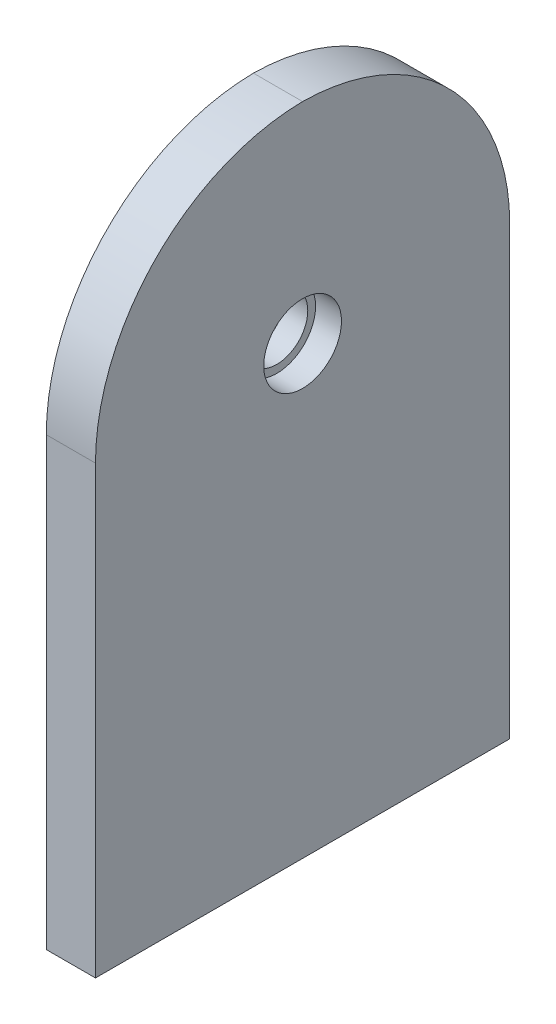
ISO-10303-21;
HEADER;
FILE_DESCRIPTION(('STEP AP214'),'2;1');
FILE_NAME('part.step','',(''),(''),'','','');
FILE_SCHEMA(('AUTOMOTIVE_DESIGN { 1 0 10303 214 1 1 1 1 }'));
ENDSEC;
DATA;
#1=APPLICATION_CONTEXT('core data for automotive mechanical design processes');
#2=APPLICATION_PROTOCOL_DEFINITION('international standard','automotive_design',2000,#1);
#3=PRODUCT_CONTEXT('',#1,'mechanical');
#4=PRODUCT('Part','Part','',(#3));
#5=PRODUCT_RELATED_PRODUCT_CATEGORY('part','',(#4));
#6=PRODUCT_DEFINITION_FORMATION('','',#4);
#7=PRODUCT_DEFINITION_CONTEXT('part definition',#1,'design');
#8=PRODUCT_DEFINITION('design','',#6,#7);
#9=PRODUCT_DEFINITION_SHAPE('','',#8);
#10=(LENGTH_UNIT() NAMED_UNIT(*) SI_UNIT(.MILLI.,.METRE.));
#11=(NAMED_UNIT(*) PLANE_ANGLE_UNIT() SI_UNIT($,.RADIAN.));
#12=(NAMED_UNIT(*) SI_UNIT($,.STERADIAN.) SOLID_ANGLE_UNIT());
#13=UNCERTAINTY_MEASURE_WITH_UNIT(LENGTH_MEASURE(1.E-05),#10,'distance_accuracy_value','');
#14=(GEOMETRIC_REPRESENTATION_CONTEXT(3) GLOBAL_UNCERTAINTY_ASSIGNED_CONTEXT((#13)) GLOBAL_UNIT_ASSIGNED_CONTEXT((#10,
#11,#12)) REPRESENTATION_CONTEXT('',''));
#15=CARTESIAN_POINT('',(0.,0.,0.));
#16=DIRECTION('',(0.,0.,1.));
#17=DIRECTION('',(1.,0.,0.));
#18=AXIS2_PLACEMENT_3D('',#15,#16,#17);
#19=CARTESIAN_POINT('',(144.666666666667,10.,39.6428499928494));
#20=DIRECTION('',(0.,1.,0.));
#21=DIRECTION('',(0.,0.,1.));
#22=AXIS2_PLACEMENT_3D('',#19,#20,#21);
#23=PLANE('',#22);
#24=CARTESIAN_POINT('',(63.25,10.,30.));
#25=DIRECTION('',(0.,-1.,0.));
#26=DIRECTION('',(0.,0.,-1.));
#27=AXIS2_PLACEMENT_3D('',#24,#25,#26);
#28=CIRCLE('',#27,1.64999999999998);
#29=CARTESIAN_POINT('',(63.25,10.,28.35));
#30=VERTEX_POINT('',#29);
#31=EDGE_CURVE('E110',#30,#30,#28,.T.);
#32=ORIENTED_EDGE('',*,*,#31,.F.);
#33=EDGE_LOOP('',(#32));
#34=FACE_BOUND('',#33,.T.);
#35=CARTESIAN_POINT('',(63.25,10.,0.));
#36=DIRECTION('',(0.,-1.,0.));
#37=DIRECTION('',(0.,0.,-1.));
#38=AXIS2_PLACEMENT_3D('',#35,#36,#37);
#39=CIRCLE('',#38,1.64999999999998);
#40=CARTESIAN_POINT('',(63.25,10.,-1.64999999999998));
#41=VERTEX_POINT('',#40);
#42=EDGE_CURVE('E109',#41,#41,#39,.T.);
#43=ORIENTED_EDGE('',*,*,#42,.F.);
#44=EDGE_LOOP('',(#43));
#45=FACE_BOUND('',#44,.T.);
#46=CARTESIAN_POINT('',(63.25,10.,-30.));
#47=DIRECTION('',(0.,-1.,0.));
#48=DIRECTION('',(0.,0.,-1.));
#49=AXIS2_PLACEMENT_3D('',#46,#47,#48);
#50=CIRCLE('',#49,1.64999999999998);
#51=CARTESIAN_POINT('',(63.25,10.,-31.65));
#52=VERTEX_POINT('',#51);
#53=EDGE_CURVE('E123',#52,#52,#50,.T.);
#54=ORIENTED_EDGE('',*,*,#53,.F.);
#55=EDGE_LOOP('',(#54));
#56=FACE_BOUND('',#55,.T.);
#57=DIRECTION('',(0.,0.,-1.));
#58=VECTOR('',#57,1.);
#59=CARTESIAN_POINT('',(68.,10.,-40.));
#60=LINE('',#59,#58);
#61=CARTESIAN_POINT('',(68.,10.,40.));
#62=VERTEX_POINT('',#61);
#63=CARTESIAN_POINT('',(68.,10.,-40.));
#64=VERTEX_POINT('',#63);
#65=EDGE_CURVE('E49',#62,#64,#60,.T.);
#66=ORIENTED_EDGE('',*,*,#65,.F.);
#67=DIRECTION('',(1.,0.,0.));
#68=VECTOR('',#67,1.);
#69=CARTESIAN_POINT('',(60.,10.,40.));
#70=LINE('',#69,#68);
#71=CARTESIAN_POINT('',(58.5,10.,40.));
#72=VERTEX_POINT('',#71);
#73=EDGE_CURVE('E185',#72,#62,#70,.T.);
#74=ORIENTED_EDGE('',*,*,#73,.F.);
#75=DIRECTION('',(0.,0.,1.));
#76=VECTOR('',#75,1.);
#77=CARTESIAN_POINT('',(58.5,10.,-40.));
#78=LINE('',#77,#76);
#79=CARTESIAN_POINT('',(58.5,10.,-40.));
#80=VERTEX_POINT('',#79);
#81=EDGE_CURVE('E147',#80,#72,#78,.T.);
#82=ORIENTED_EDGE('',*,*,#81,.F.);
#83=DIRECTION('',(-1.,0.,0.));
#84=VECTOR('',#83,1.);
#85=CARTESIAN_POINT('',(60.,10.,-40.));
#86=LINE('',#85,#84);
#87=EDGE_CURVE('E176',#64,#80,#86,.T.);
#88=ORIENTED_EDGE('',*,*,#87,.F.);
#89=EDGE_LOOP('',(#66,#74,#82,#88));
#90=FACE_BOUND('',#89,.T.);
#91=ADVANCED_FACE('F45',(#34,#45,#56,#90),#23,.F.);
#92=CARTESIAN_POINT('',(68.,96.1169830943412,-40.));
#93=DIRECTION('',(1.,0.,0.));
#94=DIRECTION('',(0.,0.,-1.));
#95=AXIS2_PLACEMENT_3D('',#92,#93,#94);
#96=PLANE('',#95);
#97=CARTESIAN_POINT('',(68.,96.1169830943412,0.));
#98=DIRECTION('',(1.,0.,0.));
#99=DIRECTION('',(0.,0.,-1.));
#100=AXIS2_PLACEMENT_3D('',#97,#98,#99);
#101=CIRCLE('',#100,7.509);
#102=CARTESIAN_POINT('',(68.,96.1169830943412,-7.509));
#103=VERTEX_POINT('',#102);
#104=EDGE_CURVE('E159',#103,#103,#101,.T.);
#105=ORIENTED_EDGE('',*,*,#104,.F.);
#106=EDGE_LOOP('',(#105));
#107=FACE_BOUND('',#106,.T.);
#108=DIRECTION('',(0.,-1.,0.));
#109=VECTOR('',#108,1.);
#110=CARTESIAN_POINT('',(68.,136.596983094341,-40.));
#111=LINE('',#110,#109);
#112=CARTESIAN_POINT('',(68.,96.1169830943412,-40.));
#113=VERTEX_POINT('',#112);
#114=EDGE_CURVE('E171',#113,#64,#111,.T.);
#115=ORIENTED_EDGE('',*,*,#114,.F.);
#116=CARTESIAN_POINT('',(68.,96.1169830943412,0.47999999999996));
#117=DIRECTION('',(-1.,0.,0.));
#118=DIRECTION('',(0.,0.,1.));
#119=AXIS2_PLACEMENT_3D('',#116,#117,#118);
#120=CIRCLE('',#119,40.48);
#121=CARTESIAN_POINT('',(68.,136.594137144496,0.));
#122=VERTEX_POINT('',#121);
#123=EDGE_CURVE('E11',#113,#122,#120,.F.);
#124=ORIENTED_EDGE('',*,*,#123,.T.);
#125=CARTESIAN_POINT('',(68.,96.1169830943412,-0.48000000000005));
#126=DIRECTION('',(-1.,0.,0.));
#127=DIRECTION('',(0.,0.,1.));
#128=AXIS2_PLACEMENT_3D('',#125,#126,#127);
#129=CIRCLE('',#128,40.48);
#130=CARTESIAN_POINT('',(68.,96.1169830943412,40.));
#131=VERTEX_POINT('',#130);
#132=EDGE_CURVE('E55',#122,#131,#129,.F.);
#133=ORIENTED_EDGE('',*,*,#132,.T.);
#134=DIRECTION('',(0.,-1.,0.));
#135=VECTOR('',#134,1.);
#136=CARTESIAN_POINT('',(68.,136.596983094341,40.));
#137=LINE('',#136,#135);
#138=EDGE_CURVE('E168',#131,#62,#137,.T.);
#139=ORIENTED_EDGE('',*,*,#138,.T.);
#140=ORIENTED_EDGE('',*,*,#65,.T.);
#141=EDGE_LOOP('',(#115,#124,#133,#139,#140));
#142=FACE_BOUND('',#141,.T.);
#143=ADVANCED_FACE('F47',(#107,#142),#96,.T.);
#144=CARTESIAN_POINT('',(60.,136.596983094341,40.));
#145=DIRECTION('',(0.,0.,-1.));
#146=DIRECTION('',(-1.,0.,0.));
#147=AXIS2_PLACEMENT_3D('',#144,#145,#146);
#148=PLANE('',#147);
#149=ORIENTED_EDGE('',*,*,#138,.F.);
#150=DIRECTION('',(1.,0.,0.));
#151=VECTOR('',#150,1.);
#152=CARTESIAN_POINT('',(60.,96.1169830943412,40.));
#153=LINE('',#152,#151);
#154=CARTESIAN_POINT('',(58.5,96.1169830943412,40.));
#155=VERTEX_POINT('',#154);
#156=EDGE_CURVE('E182',#131,#155,#153,.F.);
#157=ORIENTED_EDGE('',*,*,#156,.T.);
#158=DIRECTION('',(0.,1.,0.));
#159=VECTOR('',#158,1.);
#160=CARTESIAN_POINT('',(58.5,10.,40.));
#161=LINE('',#160,#159);
#162=EDGE_CURVE('E151',#72,#155,#161,.T.);
#163=ORIENTED_EDGE('',*,*,#162,.F.);
#164=ORIENTED_EDGE('',*,*,#73,.T.);
#165=EDGE_LOOP('',(#149,#157,#163,#164));
#166=FACE_BOUND('',#165,.T.);
#167=ADVANCED_FACE('F204',(#166),#148,.F.);
#168=CARTESIAN_POINT('',(0.,96.1169830943412,-0.48000000000005));
#169=DIRECTION('',(-1.,0.,0.));
#170=DIRECTION('',(0.,0.,1.));
#171=AXIS2_PLACEMENT_3D('',#168,#169,#170);
#172=CYLINDRICAL_SURFACE('',#171,40.48);
#173=ORIENTED_EDGE('',*,*,#156,.F.);
#174=ORIENTED_EDGE('',*,*,#132,.F.);
#175=DIRECTION('',(-1.,0.,0.));
#176=VECTOR('',#175,1.);
#177=CARTESIAN_POINT('',(64.,136.594137144496,0.));
#178=LINE('',#177,#176);
#179=CARTESIAN_POINT('',(58.5,136.594137144496,0.));
#180=VERTEX_POINT('',#179);
#181=EDGE_CURVE('E164',#180,#122,#178,.F.);
#182=ORIENTED_EDGE('',*,*,#181,.F.);
#183=CARTESIAN_POINT('',(58.5,96.1169830943412,-0.48000000000005));
#184=DIRECTION('',(-1.,0.,0.));
#185=DIRECTION('',(0.,0.,1.));
#186=AXIS2_PLACEMENT_3D('',#183,#184,#185);
#187=CIRCLE('',#186,40.48);
#188=EDGE_CURVE('E135',#155,#180,#187,.T.);
#189=ORIENTED_EDGE('',*,*,#188,.F.);
#190=EDGE_LOOP('',(#173,#174,#182,#189));
#191=FACE_BOUND('',#190,.T.);
#192=ADVANCED_FACE('F208',(#191),#172,.T.);
#193=CARTESIAN_POINT('',(60.,136.596983094341,-40.));
#194=DIRECTION('',(0.,0.,1.));
#195=DIRECTION('',(1.,0.,0.));
#196=AXIS2_PLACEMENT_3D('',#193,#194,#195);
#197=PLANE('',#196);
#198=ORIENTED_EDGE('',*,*,#87,.T.);
#199=DIRECTION('',(0.,-1.,0.));
#200=VECTOR('',#199,1.);
#201=CARTESIAN_POINT('',(58.5,96.1169830943412,-40.));
#202=LINE('',#201,#200);
#203=CARTESIAN_POINT('',(58.5,96.1169830943412,-40.));
#204=VERTEX_POINT('',#203);
#205=EDGE_CURVE('E143',#204,#80,#202,.T.);
#206=ORIENTED_EDGE('',*,*,#205,.F.);
#207=DIRECTION('',(-1.,0.,0.));
#208=VECTOR('',#207,1.);
#209=CARTESIAN_POINT('',(68.,96.1169830943412,-40.));
#210=LINE('',#209,#208);
#211=EDGE_CURVE('E175',#204,#113,#210,.F.);
#212=ORIENTED_EDGE('',*,*,#211,.T.);
#213=ORIENTED_EDGE('',*,*,#114,.T.);
#214=EDGE_LOOP('',(#198,#206,#212,#213));
#215=FACE_BOUND('',#214,.T.);
#216=ADVANCED_FACE('F193',(#215),#197,.F.);
#217=CARTESIAN_POINT('',(0.,96.1169830943412,0.47999999999996));
#218=DIRECTION('',(1.,0.,0.));
#219=DIRECTION('',(0.,0.,-1.));
#220=AXIS2_PLACEMENT_3D('',#217,#218,#219);
#221=CYLINDRICAL_SURFACE('',#220,40.48);
#222=ORIENTED_EDGE('',*,*,#123,.F.);
#223=ORIENTED_EDGE('',*,*,#211,.F.);
#224=CARTESIAN_POINT('',(58.5,96.1169830943412,0.47999999999996));
#225=DIRECTION('',(-1.,0.,0.));
#226=DIRECTION('',(0.,0.,1.));
#227=AXIS2_PLACEMENT_3D('',#224,#225,#226);
#228=CIRCLE('',#227,40.48);
#229=EDGE_CURVE('E139',#180,#204,#228,.T.);
#230=ORIENTED_EDGE('',*,*,#229,.F.);
#231=ORIENTED_EDGE('',*,*,#181,.T.);
#232=EDGE_LOOP('',(#222,#223,#230,#231));
#233=FACE_BOUND('',#232,.T.);
#234=ADVANCED_FACE('F210',(#233),#221,.T.);
#235=CARTESIAN_POINT('',(63.,96.1169830943412,0.));
#236=DIRECTION('',(1.,0.,0.));
#237=DIRECTION('',(0.,0.,-1.));
#238=AXIS2_PLACEMENT_3D('',#235,#236,#237);
#239=CYLINDRICAL_SURFACE('',#238,7.509);
#240=CARTESIAN_POINT('',(63.,96.1169830943412,0.));
#241=DIRECTION('',(1.,0.,0.));
#242=DIRECTION('',(0.,0.,-1.));
#243=AXIS2_PLACEMENT_3D('',#240,#241,#242);
#244=CIRCLE('',#243,7.509);
#245=CARTESIAN_POINT('',(63.,96.1169830943412,-7.509));
#246=VERTEX_POINT('',#245);
#247=EDGE_CURVE('E160',#246,#246,#244,.T.);
#248=ORIENTED_EDGE('',*,*,#247,.F.);
#249=EDGE_LOOP('',(#248));
#250=FACE_BOUND('',#249,.T.);
#251=ORIENTED_EDGE('',*,*,#104,.T.);
#252=EDGE_LOOP('',(#251));
#253=FACE_BOUND('',#252,.T.);
#254=ADVANCED_FACE('F214',(#250,#253),#239,.F.);
#255=CARTESIAN_POINT('',(63.,96.1169830943412,0.));
#256=DIRECTION('',(1.,0.,0.));
#257=DIRECTION('',(0.,0.,-1.));
#258=AXIS2_PLACEMENT_3D('',#255,#256,#257);
#259=PLANE('',#258);
#260=CARTESIAN_POINT('',(63.,96.1169830943412,0.));
#261=DIRECTION('',(1.,0.,0.));
#262=DIRECTION('',(0.,0.,-1.));
#263=AXIS2_PLACEMENT_3D('',#260,#261,#262);
#264=CIRCLE('',#263,6.);
#265=CARTESIAN_POINT('',(63.,96.1169830943412,-6.));
#266=VERTEX_POINT('',#265);
#267=EDGE_CURVE('E155',#266,#266,#264,.T.);
#268=ORIENTED_EDGE('',*,*,#267,.F.);
#269=EDGE_LOOP('',(#268));
#270=FACE_BOUND('',#269,.T.);
#271=ORIENTED_EDGE('',*,*,#247,.T.);
#272=EDGE_LOOP('',(#271));
#273=FACE_BOUND('',#272,.T.);
#274=ADVANCED_FACE('F223',(#270,#273),#259,.T.);
#275=CARTESIAN_POINT('',(60.,96.1169830943412,0.));
#276=DIRECTION('',(1.,0.,0.));
#277=DIRECTION('',(0.,0.,-1.));
#278=AXIS2_PLACEMENT_3D('',#275,#276,#277);
#279=CYLINDRICAL_SURFACE('',#278,6.);
#280=ORIENTED_EDGE('',*,*,#267,.T.);
#281=EDGE_LOOP('',(#280));
#282=FACE_BOUND('',#281,.T.);
#283=CARTESIAN_POINT('',(58.5,96.1169830943412,0.));
#284=DIRECTION('',(-1.,0.,0.));
#285=DIRECTION('',(0.,0.,1.));
#286=AXIS2_PLACEMENT_3D('',#283,#284,#285);
#287=CIRCLE('',#286,6.00000000000001);
#288=CARTESIAN_POINT('',(58.5,96.1169830943412,6.00000000000001));
#289=VERTEX_POINT('',#288);
#290=EDGE_CURVE('E131',#289,#289,#287,.T.);
#291=ORIENTED_EDGE('',*,*,#290,.T.);
#292=EDGE_LOOP('',(#291));
#293=FACE_BOUND('',#292,.T.);
#294=ADVANCED_FACE('F259',(#282,#293),#279,.F.);
#295=CARTESIAN_POINT('',(58.5,96.1169830943412,-0.48000000000005));
#296=DIRECTION('',(-1.,0.,0.));
#297=DIRECTION('',(0.,0.,1.));
#298=AXIS2_PLACEMENT_3D('',#295,#296,#297);
#299=PLANE('',#298);
#300=ORIENTED_EDGE('',*,*,#188,.T.);
#301=ORIENTED_EDGE('',*,*,#229,.T.);
#302=ORIENTED_EDGE('',*,*,#205,.T.);
#303=ORIENTED_EDGE('',*,*,#81,.T.);
#304=ORIENTED_EDGE('',*,*,#162,.T.);
#305=EDGE_LOOP('',(#300,#301,#302,#303,#304));
#306=FACE_BOUND('',#305,.T.);
#307=ORIENTED_EDGE('',*,*,#290,.F.);
#308=EDGE_LOOP('',(#307));
#309=FACE_BOUND('',#308,.T.);
#310=ADVANCED_FACE('F199',(#306,#309),#299,.T.);
#311=CARTESIAN_POINT('',(63.25,45.,-30.));
#312=DIRECTION('',(0.,-1.,0.));
#313=DIRECTION('',(0.,0.,-1.));
#314=AXIS2_PLACEMENT_3D('',#311,#312,#313);
#315=CONICAL_SURFACE('',#314,1.65,1.02974425867665);
#316=CARTESIAN_POINT('',(63.25,45.9914200213955,-30.));
#317=VERTEX_POINT('',#316);
#318=VERTEX_LOOP('',#317);
#319=FACE_BOUND('',#318,.T.);
#320=CARTESIAN_POINT('',(63.25,45.,-30.));
#321=DIRECTION('',(0.,-1.,0.));
#322=DIRECTION('',(0.,0.,-1.));
#323=AXIS2_PLACEMENT_3D('',#320,#321,#322);
#324=CIRCLE('',#323,1.65);
#325=CARTESIAN_POINT('',(63.25,45.,-31.65));
#326=VERTEX_POINT('',#325);
#327=EDGE_CURVE('E127',#326,#326,#324,.T.);
#328=ORIENTED_EDGE('',*,*,#327,.T.);
#329=EDGE_LOOP('',(#328));
#330=FACE_BOUND('',#329,.T.);
#331=ADVANCED_FACE('F277',(#319,#330),#315,.F.);
#332=CARTESIAN_POINT('',(63.25,10.,-30.));
#333=DIRECTION('',(0.,-1.,0.));
#334=DIRECTION('',(0.,0.,-1.));
#335=AXIS2_PLACEMENT_3D('',#332,#333,#334);
#336=CYLINDRICAL_SURFACE('',#335,1.64999999999999);
#337=ORIENTED_EDGE('',*,*,#327,.F.);
#338=EDGE_LOOP('',(#337));
#339=FACE_BOUND('',#338,.T.);
#340=ORIENTED_EDGE('',*,*,#53,.T.);
#341=EDGE_LOOP('',(#340));
#342=FACE_BOUND('',#341,.T.);
#343=ADVANCED_FACE('F286',(#339,#342),#336,.F.);
#344=CARTESIAN_POINT('',(63.25,45.,0.));
#345=DIRECTION('',(0.,-1.,0.));
#346=DIRECTION('',(0.,0.,-1.));
#347=AXIS2_PLACEMENT_3D('',#344,#345,#346);
#348=CONICAL_SURFACE('',#347,1.65,1.02974425867665);
#349=CARTESIAN_POINT('',(63.25,45.9914200213955,0.));
#350=VERTEX_POINT('',#349);
#351=VERTEX_LOOP('',#350);
#352=FACE_BOUND('',#351,.T.);
#353=CARTESIAN_POINT('',(63.25,45.,0.));
#354=DIRECTION('',(0.,-1.,0.));
#355=DIRECTION('',(0.,0.,-1.));
#356=AXIS2_PLACEMENT_3D('',#353,#354,#355);
#357=CIRCLE('',#356,1.65);
#358=CARTESIAN_POINT('',(63.25,45.,-1.65));
#359=VERTEX_POINT('',#358);
#360=EDGE_CURVE('E115',#359,#359,#357,.T.);
#361=ORIENTED_EDGE('',*,*,#360,.T.);
#362=EDGE_LOOP('',(#361));
#363=FACE_BOUND('',#362,.T.);
#364=ADVANCED_FACE('F296',(#352,#363),#348,.F.);
#365=CARTESIAN_POINT('',(63.25,10.,0.));
#366=DIRECTION('',(0.,-1.,0.));
#367=DIRECTION('',(0.,0.,-1.));
#368=AXIS2_PLACEMENT_3D('',#365,#366,#367);
#369=CYLINDRICAL_SURFACE('',#368,1.64999999999999);
#370=ORIENTED_EDGE('',*,*,#360,.F.);
#371=EDGE_LOOP('',(#370));
#372=FACE_BOUND('',#371,.T.);
#373=ORIENTED_EDGE('',*,*,#42,.T.);
#374=EDGE_LOOP('',(#373));
#375=FACE_BOUND('',#374,.T.);
#376=ADVANCED_FACE('F102',(#372,#375),#369,.F.);
#377=CARTESIAN_POINT('',(63.25,45.,30.));
#378=DIRECTION('',(0.,-1.,0.));
#379=DIRECTION('',(0.,0.,-1.));
#380=AXIS2_PLACEMENT_3D('',#377,#378,#379);
#381=CONICAL_SURFACE('',#380,1.65,1.02974425867665);
#382=CARTESIAN_POINT('',(63.25,45.9914200213955,30.));
#383=VERTEX_POINT('',#382);
#384=VERTEX_LOOP('',#383);
#385=FACE_BOUND('',#384,.T.);
#386=CARTESIAN_POINT('',(63.25,45.,30.));
#387=DIRECTION('',(0.,-1.,0.));
#388=DIRECTION('',(0.,0.,-1.));
#389=AXIS2_PLACEMENT_3D('',#386,#387,#388);
#390=CIRCLE('',#389,1.65);
#391=CARTESIAN_POINT('',(63.25,45.,28.35));
#392=VERTEX_POINT('',#391);
#393=EDGE_CURVE('E106',#392,#392,#390,.T.);
#394=ORIENTED_EDGE('',*,*,#393,.T.);
#395=EDGE_LOOP('',(#394));
#396=FACE_BOUND('',#395,.T.);
#397=ADVANCED_FACE('F98',(#385,#396),#381,.F.);
#398=CARTESIAN_POINT('',(63.25,10.,30.));
#399=DIRECTION('',(0.,-1.,0.));
#400=DIRECTION('',(0.,0.,-1.));
#401=AXIS2_PLACEMENT_3D('',#398,#399,#400);
#402=CYLINDRICAL_SURFACE('',#401,1.64999999999999);
#403=ORIENTED_EDGE('',*,*,#393,.F.);
#404=EDGE_LOOP('',(#403));
#405=FACE_BOUND('',#404,.T.);
#406=ORIENTED_EDGE('',*,*,#31,.T.);
#407=EDGE_LOOP('',(#406));
#408=FACE_BOUND('',#407,.T.);
#409=ADVANCED_FACE('F101',(#405,#408),#402,.F.);
#410=CLOSED_SHELL('',(#91,#143,#167,#192,#216,#234,#254,#274,#294,#310,#331,#343,#364,#376,#397,#409));
#411=MANIFOLD_SOLID_BREP('B2',#410);
#412=ADVANCED_BREP_SHAPE_REPRESENTATION('',(#18,#411),#14);
#413=SHAPE_DEFINITION_REPRESENTATION(#9,#412);
ENDSEC;
END-ISO-10303-21;
